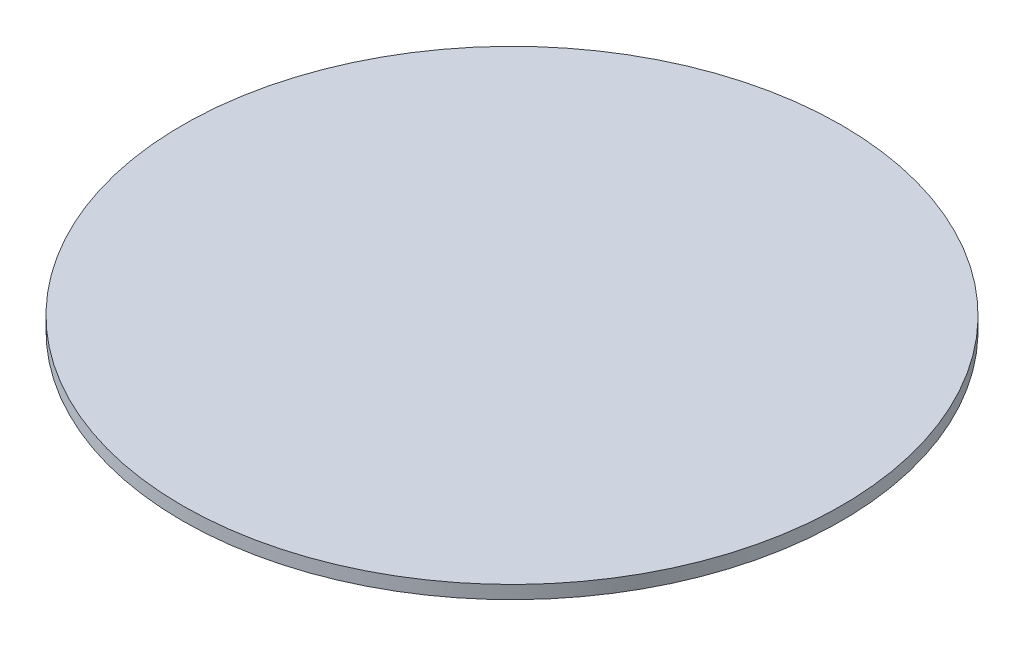
ISO-10303-21;
HEADER;
FILE_DESCRIPTION(('STEP AP214'),'2;1');
FILE_NAME('part.step','',(''),(''),'','','');
FILE_SCHEMA(('AUTOMOTIVE_DESIGN { 1 0 10303 214 1 1 1 1 }'));
ENDSEC;
DATA;
#1=APPLICATION_CONTEXT('core data for automotive mechanical design processes');
#2=APPLICATION_PROTOCOL_DEFINITION('international standard','automotive_design',2000,#1);
#3=PRODUCT_CONTEXT('',#1,'mechanical');
#4=PRODUCT('Part','Part','',(#3));
#5=PRODUCT_RELATED_PRODUCT_CATEGORY('part','',(#4));
#6=PRODUCT_DEFINITION_FORMATION('','',#4);
#7=PRODUCT_DEFINITION_CONTEXT('part definition',#1,'design');
#8=PRODUCT_DEFINITION('design','',#6,#7);
#9=PRODUCT_DEFINITION_SHAPE('','',#8);
#10=(LENGTH_UNIT() NAMED_UNIT(*) SI_UNIT(.MILLI.,.METRE.));
#11=(NAMED_UNIT(*) PLANE_ANGLE_UNIT() SI_UNIT($,.RADIAN.));
#12=(NAMED_UNIT(*) SI_UNIT($,.STERADIAN.) SOLID_ANGLE_UNIT());
#13=UNCERTAINTY_MEASURE_WITH_UNIT(LENGTH_MEASURE(1.E-05),#10,'distance_accuracy_value','');
#14=(GEOMETRIC_REPRESENTATION_CONTEXT(3) GLOBAL_UNCERTAINTY_ASSIGNED_CONTEXT((#13)) GLOBAL_UNIT_ASSIGNED_CONTEXT((#10,
#11,#12)) REPRESENTATION_CONTEXT('',''));
#15=CARTESIAN_POINT('',(0.,0.,0.));
#16=DIRECTION('',(0.,0.,1.));
#17=DIRECTION('',(1.,0.,0.));
#18=AXIS2_PLACEMENT_3D('',#15,#16,#17);
#19=CARTESIAN_POINT('',(0.,0.8,0.));
#20=DIRECTION('',(0.,-1.,0.));
#21=DIRECTION('',(0.,0.,-1.));
#22=AXIS2_PLACEMENT_3D('',#19,#20,#21);
#23=CYLINDRICAL_SURFACE('',#22,20.);
#24=CARTESIAN_POINT('',(0.,0.8,0.));
#25=DIRECTION('',(0.,1.,0.));
#26=DIRECTION('',(0.,0.,1.));
#27=AXIS2_PLACEMENT_3D('',#24,#25,#26);
#28=CIRCLE('',#27,20.);
#29=CARTESIAN_POINT('',(0.,0.8,20.));
#30=VERTEX_POINT('',#29);
#31=EDGE_CURVE('E10',#30,#30,#28,.T.);
#32=ORIENTED_EDGE('',*,*,#31,.F.);
#33=EDGE_LOOP('',(#32));
#34=FACE_BOUND('',#33,.T.);
#35=CARTESIAN_POINT('',(0.,0.,0.));
#36=DIRECTION('',(0.,1.,0.));
#37=DIRECTION('',(0.,0.,1.));
#38=AXIS2_PLACEMENT_3D('',#35,#36,#37);
#39=CIRCLE('',#38,20.);
#40=CARTESIAN_POINT('',(0.,0.,20.));
#41=VERTEX_POINT('',#40);
#42=EDGE_CURVE('E33',#41,#41,#39,.T.);
#43=ORIENTED_EDGE('',*,*,#42,.T.);
#44=EDGE_LOOP('',(#43));
#45=FACE_BOUND('',#44,.T.);
#46=ADVANCED_FACE('F30',(#34,#45),#23,.T.);
#47=CARTESIAN_POINT('',(0.,0.8,0.));
#48=DIRECTION('',(0.,1.,0.));
#49=DIRECTION('',(0.,0.,1.));
#50=AXIS2_PLACEMENT_3D('',#47,#48,#49);
#51=PLANE('',#50);
#52=ORIENTED_EDGE('',*,*,#31,.T.);
#53=EDGE_LOOP('',(#52));
#54=FACE_BOUND('',#53,.T.);
#55=ADVANCED_FACE('F45',(#54),#51,.T.);
#56=CARTESIAN_POINT('',(0.,0.,0.));
#57=DIRECTION('',(0.,1.,0.));
#58=DIRECTION('',(0.,0.,1.));
#59=AXIS2_PLACEMENT_3D('',#56,#57,#58);
#60=PLANE('',#59);
#61=ORIENTED_EDGE('',*,*,#42,.F.);
#62=EDGE_LOOP('',(#61));
#63=FACE_BOUND('',#62,.T.);
#64=ADVANCED_FACE('F43',(#63),#60,.F.);
#65=CLOSED_SHELL('',(#46,#55,#64));
#66=MANIFOLD_SOLID_BREP('B2',#65);
#67=ADVANCED_BREP_SHAPE_REPRESENTATION('',(#18,#66),#14);
#68=SHAPE_DEFINITION_REPRESENTATION(#9,#67);
ENDSEC;
END-ISO-10303-21;
